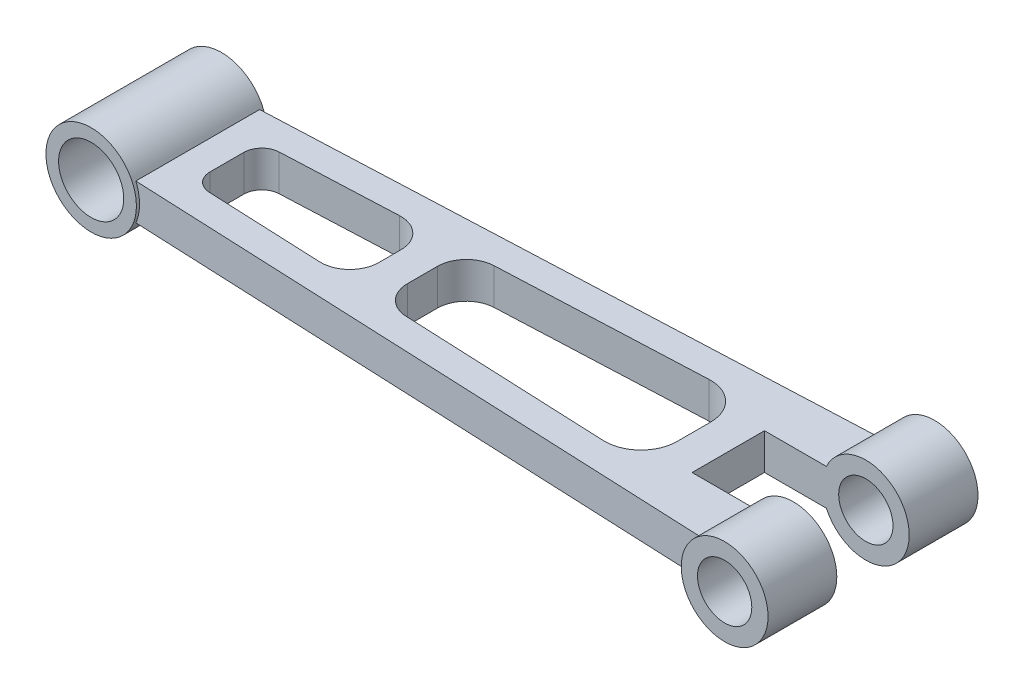
ISO-10303-21;
HEADER;
FILE_DESCRIPTION(('STEP AP214'),'2;1');
FILE_NAME('part.step','',(''),(''),'','','');
FILE_SCHEMA(('AUTOMOTIVE_DESIGN { 1 0 10303 214 1 1 1 1 }'));
ENDSEC;
DATA;
#1=APPLICATION_CONTEXT('core data for automotive mechanical design processes');
#2=APPLICATION_PROTOCOL_DEFINITION('international standard','automotive_design',2000,#1);
#3=PRODUCT_CONTEXT('',#1,'mechanical');
#4=PRODUCT('Part','Part','',(#3));
#5=PRODUCT_RELATED_PRODUCT_CATEGORY('part','',(#4));
#6=PRODUCT_DEFINITION_FORMATION('','',#4);
#7=PRODUCT_DEFINITION_CONTEXT('part definition',#1,'design');
#8=PRODUCT_DEFINITION('design','',#6,#7);
#9=PRODUCT_DEFINITION_SHAPE('','',#8);
#10=(LENGTH_UNIT() NAMED_UNIT(*) SI_UNIT(.MILLI.,.METRE.));
#11=(NAMED_UNIT(*) PLANE_ANGLE_UNIT() SI_UNIT($,.RADIAN.));
#12=(NAMED_UNIT(*) SI_UNIT($,.STERADIAN.) SOLID_ANGLE_UNIT());
#13=UNCERTAINTY_MEASURE_WITH_UNIT(LENGTH_MEASURE(1.E-05),#10,'distance_accuracy_value','');
#14=(GEOMETRIC_REPRESENTATION_CONTEXT(3) GLOBAL_UNCERTAINTY_ASSIGNED_CONTEXT((#13)) GLOBAL_UNIT_ASSIGNED_CONTEXT((#10,
#11,#12)) REPRESENTATION_CONTEXT('',''));
#15=CARTESIAN_POINT('',(0.,0.,0.));
#16=DIRECTION('',(0.,0.,1.));
#17=DIRECTION('',(1.,0.,0.));
#18=AXIS2_PLACEMENT_3D('',#15,#16,#17);
#19=CARTESIAN_POINT('',(-93.25,5.,-18.));
#20=DIRECTION('',(0.,0.,1.));
#21=DIRECTION('',(1.,0.,0.));
#22=AXIS2_PLACEMENT_3D('',#19,#20,#21);
#23=CYLINDRICAL_SURFACE('',#22,12.5);
#24=CARTESIAN_POINT('',(-93.25,5.,-18.));
#25=DIRECTION('',(0.,0.,1.));
#26=DIRECTION('',(1.,0.,0.));
#27=AXIS2_PLACEMENT_3D('',#24,#25,#26);
#28=CIRCLE('',#27,12.5);
#29=CARTESIAN_POINT('',(-80.75,5.,-18.));
#30=VERTEX_POINT('',#29);
#31=EDGE_CURVE('E11',#30,#30,#28,.T.);
#32=ORIENTED_EDGE('',*,*,#31,.T.);
#33=EDGE_LOOP('',(#32));
#34=FACE_BOUND('',#33,.T.);
#35=CARTESIAN_POINT('',(-93.25,5.,18.));
#36=DIRECTION('',(0.,0.,1.));
#37=DIRECTION('',(1.,0.,0.));
#38=AXIS2_PLACEMENT_3D('',#35,#36,#37);
#39=CIRCLE('',#38,12.5);
#40=CARTESIAN_POINT('',(-80.75,5.,18.));
#41=VERTEX_POINT('',#40);
#42=EDGE_CURVE('E57',#41,#41,#39,.T.);
#43=ORIENTED_EDGE('',*,*,#42,.F.);
#44=EDGE_LOOP('',(#43));
#45=FACE_BOUND('',#44,.T.);
#46=ADVANCED_FACE('F51',(#34,#45),#23,.T.);
#47=CARTESIAN_POINT('',(-93.25,5.,-18.));
#48=DIRECTION('',(0.,0.,1.));
#49=DIRECTION('',(1.,0.,0.));
#50=AXIS2_PLACEMENT_3D('',#47,#48,#49);
#51=PLANE('',#50);
#52=CARTESIAN_POINT('',(-93.25,5.,-18.));
#53=DIRECTION('',(0.,0.,1.));
#54=DIRECTION('',(1.,0.,0.));
#55=AXIS2_PLACEMENT_3D('',#52,#53,#54);
#56=CIRCLE('',#55,9.);
#57=CARTESIAN_POINT('',(-84.25,5.,-18.));
#58=VERTEX_POINT('',#57);
#59=EDGE_CURVE('E61',#58,#58,#56,.T.);
#60=ORIENTED_EDGE('',*,*,#59,.T.);
#61=EDGE_LOOP('',(#60));
#62=FACE_BOUND('',#61,.T.);
#63=ORIENTED_EDGE('',*,*,#31,.F.);
#64=EDGE_LOOP('',(#63));
#65=FACE_BOUND('',#64,.T.);
#66=ADVANCED_FACE('F76',(#62,#65),#51,.F.);
#67=CARTESIAN_POINT('',(-93.25,5.,18.));
#68=DIRECTION('',(0.,0.,1.));
#69=DIRECTION('',(1.,0.,0.));
#70=AXIS2_PLACEMENT_3D('',#67,#68,#69);
#71=PLANE('',#70);
#72=CARTESIAN_POINT('',(-93.25,5.,18.));
#73=DIRECTION('',(0.,0.,1.));
#74=DIRECTION('',(1.,0.,0.));
#75=AXIS2_PLACEMENT_3D('',#72,#73,#74);
#76=CIRCLE('',#75,9.);
#77=CARTESIAN_POINT('',(-84.25,5.,18.));
#78=VERTEX_POINT('',#77);
#79=EDGE_CURVE('E65',#78,#78,#76,.T.);
#80=ORIENTED_EDGE('',*,*,#79,.F.);
#81=EDGE_LOOP('',(#80));
#82=FACE_BOUND('',#81,.T.);
#83=ORIENTED_EDGE('',*,*,#42,.T.);
#84=EDGE_LOOP('',(#83));
#85=FACE_BOUND('',#84,.T.);
#86=ADVANCED_FACE('F74',(#82,#85),#71,.T.);
#87=CARTESIAN_POINT('',(-93.25,5.,-24.2802101213737));
#88=DIRECTION('',(0.,0.,1.));
#89=DIRECTION('',(1.,0.,0.));
#90=AXIS2_PLACEMENT_3D('',#87,#88,#89);
#91=CYLINDRICAL_SURFACE('',#90,9.);
#92=ORIENTED_EDGE('',*,*,#79,.T.);
#93=EDGE_LOOP('',(#92));
#94=FACE_BOUND('',#93,.T.);
#95=ORIENTED_EDGE('',*,*,#59,.F.);
#96=EDGE_LOOP('',(#95));
#97=FACE_BOUND('',#96,.T.);
#98=ADVANCED_FACE('F71',(#94,#97),#91,.F.);
#99=CLOSED_SHELL('',(#46,#66,#86,#98));
#100=MANIFOLD_SOLID_BREP('B2',#99);
#101=CARTESIAN_POINT('',(92.7404822158186,5.,-29.));
#102=DIRECTION('',(0.,0.,1.));
#103=DIRECTION('',(1.,0.,0.));
#104=AXIS2_PLACEMENT_3D('',#101,#102,#103);
#105=CYLINDRICAL_SURFACE('',#104,11.9885786589823);
#106=DIRECTION('',(0.,0.,1.));
#107=VECTOR('',#106,1.);
#108=CARTESIAN_POINT('',(81.8443352701039,10.,-29.));
#109=LINE('',#108,#107);
#110=CARTESIAN_POINT('',(81.8443352701039,10.,-10.));
#111=VERTEX_POINT('',#110);
#112=CARTESIAN_POINT('',(81.8443352701039,10.,-24.2406679453075));
#113=VERTEX_POINT('',#112);
#114=EDGE_CURVE('E308',#111,#113,#109,.F.);
#115=ORIENTED_EDGE('',*,*,#114,.F.);
#116=CARTESIAN_POINT('',(92.7404822158186,5.,-10.));
#117=DIRECTION('',(0.,0.,-1.));
#118=DIRECTION('',(-1.,0.,0.));
#119=AXIS2_PLACEMENT_3D('',#116,#117,#118);
#120=CIRCLE('',#119,11.9885786589823);
#121=CARTESIAN_POINT('',(81.8443352701039,0.,-10.));
#122=VERTEX_POINT('',#121);
#123=EDGE_CURVE('E295',#122,#111,#120,.F.);
#124=ORIENTED_EDGE('',*,*,#123,.F.);
#125=DIRECTION('',(0.,0.,1.));
#126=VECTOR('',#125,1.);
#127=CARTESIAN_POINT('',(81.8443352701039,0.,-29.));
#128=LINE('',#127,#126);
#129=CARTESIAN_POINT('',(81.8443352701039,0.,-24.2406679453075));
#130=VERTEX_POINT('',#129);
#131=EDGE_CURVE('E918',#122,#130,#128,.F.);
#132=ORIENTED_EDGE('',*,*,#131,.T.);
#133=CARTESIAN_POINT('',(92.7404822158186,5.,-24.716403995027));
#134=DIRECTION('',(0.0436193873653291,0.,0.999048221581858));
#135=DIRECTION('',(-0.999048221581858,0.,0.0436193873653291));
#136=AXIS2_PLACEMENT_3D('',#133,#134,#135);
#137=ELLIPSE('',#136,12.,11.9885786589823);
#138=EDGE_CURVE('E442',#113,#130,#137,.T.);
#139=ORIENTED_EDGE('',*,*,#138,.F.);
#140=EDGE_LOOP('',(#115,#124,#132,#139));
#141=FACE_BOUND('',#140,.T.);
#142=CARTESIAN_POINT('',(92.7404822158186,5.,-29.));
#143=DIRECTION('',(0.,0.,1.));
#144=DIRECTION('',(1.,0.,0.));
#145=AXIS2_PLACEMENT_3D('',#142,#143,#144);
#146=CIRCLE('',#145,11.9885786589823);
#147=CARTESIAN_POINT('',(104.729060874801,5.,-29.));
#148=VERTEX_POINT('',#147);
#149=EDGE_CURVE('E949',#148,#148,#146,.T.);
#150=ORIENTED_EDGE('',*,*,#149,.T.);
#151=EDGE_LOOP('',(#150));
#152=FACE_BOUND('',#151,.T.);
#153=ADVANCED_FACE('F121',(#141,#152),#105,.T.);
#154=CARTESIAN_POINT('',(92.7404822158186,5.,-29.));
#155=DIRECTION('',(0.,0.,1.));
#156=DIRECTION('',(1.,0.,0.));
#157=AXIS2_PLACEMENT_3D('',#154,#155,#156);
#158=CYLINDRICAL_SURFACE('',#157,7.50000000000001);
#159=CARTESIAN_POINT('',(92.7404822158186,5.,-29.));
#160=DIRECTION('',(0.,0.,1.));
#161=DIRECTION('',(1.,0.,0.));
#162=AXIS2_PLACEMENT_3D('',#159,#160,#161);
#163=CIRCLE('',#162,7.50000000000001);
#164=CARTESIAN_POINT('',(100.240482215819,5.,-29.));
#165=VERTEX_POINT('',#164);
#166=EDGE_CURVE('E941',#165,#165,#163,.T.);
#167=ORIENTED_EDGE('',*,*,#166,.F.);
#168=EDGE_LOOP('',(#167));
#169=FACE_BOUND('',#168,.T.);
#170=CARTESIAN_POINT('',(92.7404822158186,5.,-10.));
#171=DIRECTION('',(0.,0.,-1.));
#172=DIRECTION('',(-1.,0.,0.));
#173=AXIS2_PLACEMENT_3D('',#170,#171,#172);
#174=CIRCLE('',#173,7.50000000000001);
#175=CARTESIAN_POINT('',(85.2404822158186,5.,-10.));
#176=VERTEX_POINT('',#175);
#177=EDGE_CURVE('E49',#176,#176,#174,.F.);
#178=ORIENTED_EDGE('',*,*,#177,.T.);
#179=EDGE_LOOP('',(#178));
#180=FACE_BOUND('',#179,.T.);
#181=ADVANCED_FACE('F553',(#169,#180),#158,.F.);
#182=CARTESIAN_POINT('',(-82.75,10.,-17.0543240700161));
#183=DIRECTION('',(0.0436193873653291,0.,0.999048221581858));
#184=DIRECTION('',(0.999048221581858,0.,-0.0436193873653291));
#185=AXIS2_PLACEMENT_3D('',#182,#183,#184);
#186=PLANE('',#185);
#187=DIRECTION('',(-0.999048221581858,0.,0.0436193873653291));
#188=VECTOR('',#187,1.);
#189=CARTESIAN_POINT('',(-82.75,10.,-17.0543240700161));
#190=LINE('',#189,#188);
#191=CARTESIAN_POINT('',(-82.75,10.,-17.0543240700161));
#192=VERTEX_POINT('',#191);
#193=EDGE_CURVE('E513',#113,#192,#190,.T.);
#194=ORIENTED_EDGE('',*,*,#193,.F.);
#195=ORIENTED_EDGE('',*,*,#138,.T.);
#196=DIRECTION('',(-0.999048221581858,0.,0.0436193873653291));
#197=VECTOR('',#196,1.);
#198=CARTESIAN_POINT('',(-82.75,0.,-17.0543240700161));
#199=LINE('',#198,#197);
#200=CARTESIAN_POINT('',(-82.75,0.,-17.0543240700161));
#201=VERTEX_POINT('',#200);
#202=EDGE_CURVE('E512',#130,#201,#199,.T.);
#203=ORIENTED_EDGE('',*,*,#202,.T.);
#204=DIRECTION('',(0.,-1.,0.));
#205=VECTOR('',#204,1.);
#206=CARTESIAN_POINT('',(-82.75,10.,-17.0543240700161));
#207=LINE('',#206,#205);
#208=EDGE_CURVE('E520',#192,#201,#207,.T.);
#209=ORIENTED_EDGE('',*,*,#208,.F.);
#210=EDGE_LOOP('',(#194,#195,#203,#209));
#211=FACE_BOUND('',#210,.T.);
#212=ADVANCED_FACE('F123',(#211),#186,.F.);
#213=CARTESIAN_POINT('',(-82.75,10.,0.));
#214=DIRECTION('',(1.,0.,0.));
#215=DIRECTION('',(0.,0.,-1.));
#216=AXIS2_PLACEMENT_3D('',#213,#214,#215);
#217=PLANE('',#216);
#218=DIRECTION('',(0.,0.,1.));
#219=VECTOR('',#218,1.);
#220=CARTESIAN_POINT('',(-82.75,0.,0.));
#221=LINE('',#220,#219);
#222=CARTESIAN_POINT('',(-82.75,0.,17.0543240700161));
#223=VERTEX_POINT('',#222);
#224=EDGE_CURVE('E517',#201,#223,#221,.T.);
#225=ORIENTED_EDGE('',*,*,#224,.T.);
#226=DIRECTION('',(0.,-1.,0.));
#227=VECTOR('',#226,1.);
#228=CARTESIAN_POINT('',(-82.75,10.,17.0543240700161));
#229=LINE('',#228,#227);
#230=CARTESIAN_POINT('',(-82.75,10.,17.0543240700161));
#231=VERTEX_POINT('',#230);
#232=EDGE_CURVE('E506',#231,#223,#229,.T.);
#233=ORIENTED_EDGE('',*,*,#232,.F.);
#234=DIRECTION('',(0.,0.,1.));
#235=VECTOR('',#234,1.);
#236=CARTESIAN_POINT('',(-82.75,10.,0.));
#237=LINE('',#236,#235);
#238=EDGE_CURVE('E516',#192,#231,#237,.T.);
#239=ORIENTED_EDGE('',*,*,#238,.F.);
#240=ORIENTED_EDGE('',*,*,#208,.T.);
#241=EDGE_LOOP('',(#225,#233,#239,#240));
#242=FACE_BOUND('',#241,.T.);
#243=ADVANCED_FACE('F624',(#242),#217,.F.);
#244=CARTESIAN_POINT('',(0.,10.,0.));
#245=DIRECTION('',(0.,-1.,0.));
#246=DIRECTION('',(0.,0.,-1.));
#247=AXIS2_PLACEMENT_3D('',#244,#245,#246);
#248=PLANE('',#247);
#249=DIRECTION('',(0.,0.,1.));
#250=VECTOR('',#249,1.);
#251=CARTESIAN_POINT('',(-73.75,10.,4.653192363612));
#252=LINE('',#251,#250);
#253=CARTESIAN_POINT('',(-73.75,10.,-4.653192363612));
#254=VERTEX_POINT('',#253);
#255=CARTESIAN_POINT('',(-73.75,10.,4.653192363612));
#256=VERTEX_POINT('',#255);
#257=EDGE_CURVE('E381',#254,#256,#252,.T.);
#258=ORIENTED_EDGE('',*,*,#257,.F.);
#259=CARTESIAN_POINT('',(-68.75,10.,-4.65319236361204));
#260=DIRECTION('',(0.,1.,0.));
#261=DIRECTION('',(0.,0.,1.));
#262=AXIS2_PLACEMENT_3D('',#259,#260,#261);
#263=CIRCLE('',#262,5.);
#264=CARTESIAN_POINT('',(-68.9680969368266,10.,-9.64843347152133));
#265=VERTEX_POINT('',#264);
#266=EDGE_CURVE('E137',#265,#254,#263,.T.);
#267=ORIENTED_EDGE('',*,*,#266,.F.);
#268=DIRECTION('',(-0.999048221581858,0.,0.0436193873653292));
#269=VECTOR('',#268,1.);
#270=CARTESIAN_POINT('',(-68.9680969368266,10.,-9.64843347152133));
#271=LINE('',#270,#269);
#272=CARTESIAN_POINT('',(-37.0989550989227,10.,-11.0398702538491));
#273=VERTEX_POINT('',#272);
#274=EDGE_CURVE('E356',#273,#265,#271,.T.);
#275=ORIENTED_EDGE('',*,*,#274,.F.);
#276=CARTESIAN_POINT('',(-36.75,10.,-3.04748448119425));
#277=DIRECTION('',(0.,1.,0.));
#278=DIRECTION('',(0.,0.,-1.));
#279=AXIS2_PLACEMENT_3D('',#276,#277,#278);
#280=CIRCLE('',#279,8.);
#281=CARTESIAN_POINT('',(-28.75,10.,-3.04748448119419));
#282=VERTEX_POINT('',#281);
#283=EDGE_CURVE('E360',#282,#273,#280,.T.);
#284=ORIENTED_EDGE('',*,*,#283,.F.);
#285=DIRECTION('',(0.,0.,-1.));
#286=VECTOR('',#285,1.);
#287=CARTESIAN_POINT('',(-28.75,10.,-3.04748448119419));
#288=LINE('',#287,#286);
#289=CARTESIAN_POINT('',(-28.75,10.,3.04748448119418));
#290=VERTEX_POINT('',#289);
#291=EDGE_CURVE('E365',#290,#282,#288,.T.);
#292=ORIENTED_EDGE('',*,*,#291,.F.);
#293=CARTESIAN_POINT('',(-36.75,10.,3.04748448119424));
#294=DIRECTION('',(0.,1.,0.));
#295=DIRECTION('',(0.,0.,-1.));
#296=AXIS2_PLACEMENT_3D('',#293,#294,#295);
#297=CIRCLE('',#296,8.);
#298=CARTESIAN_POINT('',(-37.0989550989227,10.,11.0398702538491));
#299=VERTEX_POINT('',#298);
#300=EDGE_CURVE('E369',#299,#290,#297,.T.);
#301=ORIENTED_EDGE('',*,*,#300,.F.);
#302=DIRECTION('',(0.999048221581858,0.,0.0436193873653291));
#303=VECTOR('',#302,1.);
#304=CARTESIAN_POINT('',(-37.0989550989227,10.,11.0398702538491));
#305=LINE('',#304,#303);
#306=CARTESIAN_POINT('',(-68.9680969368266,10.,9.64843347152132));
#307=VERTEX_POINT('',#306);
#308=EDGE_CURVE('E373',#307,#299,#305,.T.);
#309=ORIENTED_EDGE('',*,*,#308,.F.);
#310=CARTESIAN_POINT('',(-68.75,10.,4.65319236361203));
#311=DIRECTION('',(0.,1.,0.));
#312=DIRECTION('',(0.,0.,-1.));
#313=AXIS2_PLACEMENT_3D('',#310,#311,#312);
#314=CIRCLE('',#313,5.);
#315=EDGE_CURVE('E377',#256,#307,#314,.T.);
#316=ORIENTED_EDGE('',*,*,#315,.F.);
#317=EDGE_LOOP('',(#258,#267,#275,#284,#292,#301,#309,#316));
#318=FACE_BOUND('',#317,.T.);
#319=DIRECTION('',(0.999048221581858,0.,0.043619387365329));
#320=VECTOR('',#319,1.);
#321=CARTESIAN_POINT('',(-12.0989550989226,10.,12.1313938265617));
#322=LINE('',#321,#320);
#323=CARTESIAN_POINT('',(-12.0989550989226,10.,12.1313938265617));
#324=VERTEX_POINT('',#323);
#325=CARTESIAN_POINT('',(44.8138061263466,10.,14.6162586451836));
#326=VERTEX_POINT('',#325);
#327=EDGE_CURVE('E468',#324,#326,#322,.T.);
#328=ORIENTED_EDGE('',*,*,#327,.F.);
#329=CARTESIAN_POINT('',(-11.75,10.,4.13900805390687));
#330=DIRECTION('',(0.,1.,0.));
#331=DIRECTION('',(0.,0.,1.));
#332=AXIS2_PLACEMENT_3D('',#329,#330,#331);
#333=CIRCLE('',#332,8.);
#334=CARTESIAN_POINT('',(-19.75,10.,4.13900805390682));
#335=VERTEX_POINT('',#334);
#336=EDGE_CURVE('E145',#335,#324,#333,.T.);
#337=ORIENTED_EDGE('',*,*,#336,.F.);
#338=DIRECTION('',(0.,0.,1.));
#339=VECTOR('',#338,1.);
#340=CARTESIAN_POINT('',(-19.75,10.,-4.13900805390681));
#341=LINE('',#340,#339);
#342=CARTESIAN_POINT('',(-19.75,10.,-4.13900805390681));
#343=VERTEX_POINT('',#342);
#344=EDGE_CURVE('E443',#343,#335,#341,.T.);
#345=ORIENTED_EDGE('',*,*,#344,.F.);
#346=CARTESIAN_POINT('',(-11.75,10.,-4.13900805390687));
#347=DIRECTION('',(0.,1.,0.));
#348=DIRECTION('',(0.,0.,-1.));
#349=AXIS2_PLACEMENT_3D('',#346,#347,#348);
#350=CIRCLE('',#349,8.);
#351=CARTESIAN_POINT('',(-12.0989550989226,10.,-12.1313938265617));
#352=VERTEX_POINT('',#351);
#353=EDGE_CURVE('E447',#352,#343,#350,.T.);
#354=ORIENTED_EDGE('',*,*,#353,.F.);
#355=DIRECTION('',(-0.999048221581858,0.,0.0436193873653291));
#356=VECTOR('',#355,1.);
#357=CARTESIAN_POINT('',(44.8138061263466,10.,-14.6162586451836));
#358=LINE('',#357,#356);
#359=CARTESIAN_POINT('',(44.8138061263466,10.,-14.6162586451836));
#360=VERTEX_POINT('',#359);
#361=EDGE_CURVE('E452',#360,#352,#358,.T.);
#362=ORIENTED_EDGE('',*,*,#361,.F.);
#363=CARTESIAN_POINT('',(45.25,10.,-4.62577642936502));
#364=DIRECTION('',(0.,1.,0.));
#365=DIRECTION('',(0.,0.,1.));
#366=AXIS2_PLACEMENT_3D('',#363,#364,#365);
#367=CIRCLE('',#366,10.);
#368=CARTESIAN_POINT('',(55.25,10.,-4.62577642936495));
#369=VERTEX_POINT('',#368);
#370=EDGE_CURVE('E456',#369,#360,#367,.T.);
#371=ORIENTED_EDGE('',*,*,#370,.F.);
#372=DIRECTION('',(0.,0.,-1.));
#373=VECTOR('',#372,1.);
#374=CARTESIAN_POINT('',(55.25,10.,4.62577642936494));
#375=LINE('',#374,#373);
#376=CARTESIAN_POINT('',(55.25,10.,4.62577642936494));
#377=VERTEX_POINT('',#376);
#378=EDGE_CURVE('E460',#377,#369,#375,.T.);
#379=ORIENTED_EDGE('',*,*,#378,.F.);
#380=CARTESIAN_POINT('',(45.25,10.,4.62577642936501));
#381=DIRECTION('',(0.,1.,0.));
#382=DIRECTION('',(0.,0.,1.));
#383=AXIS2_PLACEMENT_3D('',#380,#381,#382);
#384=CIRCLE('',#383,10.);
#385=EDGE_CURVE('E464',#326,#377,#384,.T.);
#386=ORIENTED_EDGE('',*,*,#385,.F.);
#387=EDGE_LOOP('',(#328,#337,#345,#354,#362,#371,#379,#386));
#388=FACE_BOUND('',#387,.T.);
#389=DIRECTION('',(-0.999048221581858,0.,-0.0436193873653291));
#390=VECTOR('',#389,1.);
#391=CARTESIAN_POINT('',(-82.75,10.,17.0543240700161));
#392=LINE('',#391,#390);
#393=CARTESIAN_POINT('',(81.8443352701039,10.,24.2406679453075));
#394=VERTEX_POINT('',#393);
#395=EDGE_CURVE('E304',#394,#231,#392,.T.);
#396=ORIENTED_EDGE('',*,*,#395,.F.);
#397=CARTESIAN_POINT('',(81.8443352701039,10.,10.));
#398=VERTEX_POINT('',#397);
#399=EDGE_CURVE('E286',#394,#398,#109,.F.);
#400=ORIENTED_EDGE('',*,*,#399,.T.);
#401=DIRECTION('',(1.,0.,0.));
#402=VECTOR('',#401,1.);
#403=CARTESIAN_POINT('',(64.75,10.,10.));
#404=LINE('',#403,#402);
#405=CARTESIAN_POINT('',(64.75,10.,10.));
#406=VERTEX_POINT('',#405);
#407=EDGE_CURVE('E302',#406,#398,#404,.T.);
#408=ORIENTED_EDGE('',*,*,#407,.F.);
#409=DIRECTION('',(0.,0.,1.));
#410=VECTOR('',#409,1.);
#411=CARTESIAN_POINT('',(64.75,10.,-10.));
#412=LINE('',#411,#410);
#413=CARTESIAN_POINT('',(64.75,10.,-10.));
#414=VERTEX_POINT('',#413);
#415=EDGE_CURVE('E314',#414,#406,#412,.T.);
#416=ORIENTED_EDGE('',*,*,#415,.F.);
#417=DIRECTION('',(-1.,0.,0.));
#418=VECTOR('',#417,1.);
#419=CARTESIAN_POINT('',(64.75,10.,-10.));
#420=LINE('',#419,#418);
#421=EDGE_CURVE('E313',#111,#414,#420,.T.);
#422=ORIENTED_EDGE('',*,*,#421,.F.);
#423=ORIENTED_EDGE('',*,*,#114,.T.);
#424=ORIENTED_EDGE('',*,*,#193,.T.);
#425=ORIENTED_EDGE('',*,*,#238,.T.);
#426=EDGE_LOOP('',(#396,#400,#408,#416,#422,#423,#424,#425));
#427=FACE_BOUND('',#426,.T.);
#428=ADVANCED_FACE('F300',(#318,#388,#427),#248,.F.);
#429=CARTESIAN_POINT('',(0.,0.,0.));
#430=DIRECTION('',(0.,-1.,0.));
#431=DIRECTION('',(0.,0.,-1.));
#432=AXIS2_PLACEMENT_3D('',#429,#430,#431);
#433=PLANE('',#432);
#434=CARTESIAN_POINT('',(81.8443352701039,0.,24.2406679453075));
#435=VERTEX_POINT('',#434);
#436=CARTESIAN_POINT('',(81.8443352701039,0.,10.));
#437=VERTEX_POINT('',#436);
#438=EDGE_CURVE('E289',#435,#437,#128,.F.);
#439=ORIENTED_EDGE('',*,*,#438,.F.);
#440=DIRECTION('',(-0.999048221581858,0.,-0.0436193873653291));
#441=VECTOR('',#440,1.);
#442=CARTESIAN_POINT('',(-82.75,0.,17.0543240700161));
#443=LINE('',#442,#441);
#444=EDGE_CURVE('E327',#435,#223,#443,.T.);
#445=ORIENTED_EDGE('',*,*,#444,.T.);
#446=ORIENTED_EDGE('',*,*,#224,.F.);
#447=ORIENTED_EDGE('',*,*,#202,.F.);
#448=ORIENTED_EDGE('',*,*,#131,.F.);
#449=DIRECTION('',(1.,0.,0.));
#450=VECTOR('',#449,1.);
#451=CARTESIAN_POINT('',(0.,0.,-10.));
#452=LINE('',#451,#450);
#453=CARTESIAN_POINT('',(64.75,0.,-10.));
#454=VERTEX_POINT('',#453);
#455=EDGE_CURVE('E529',#454,#122,#452,.T.);
#456=ORIENTED_EDGE('',*,*,#455,.F.);
#457=DIRECTION('',(0.,0.,1.));
#458=VECTOR('',#457,1.);
#459=CARTESIAN_POINT('',(64.75,0.,-10.));
#460=LINE('',#459,#458);
#461=CARTESIAN_POINT('',(64.75,0.,10.));
#462=VERTEX_POINT('',#461);
#463=EDGE_CURVE('E318',#454,#462,#460,.T.);
#464=ORIENTED_EDGE('',*,*,#463,.T.);
#465=DIRECTION('',(1.,0.,0.));
#466=VECTOR('',#465,1.);
#467=CARTESIAN_POINT('',(64.75,0.,10.));
#468=LINE('',#467,#466);
#469=EDGE_CURVE('E330',#462,#437,#468,.T.);
#470=ORIENTED_EDGE('',*,*,#469,.T.);
#471=EDGE_LOOP('',(#439,#445,#446,#447,#448,#456,#464,#470));
#472=FACE_BOUND('',#471,.T.);
#473=CARTESIAN_POINT('',(-68.75,0.,-4.65319236361204));
#474=DIRECTION('',(0.,1.,0.));
#475=DIRECTION('',(0.,0.,1.));
#476=AXIS2_PLACEMENT_3D('',#473,#474,#475);
#477=CIRCLE('',#476,5.);
#478=CARTESIAN_POINT('',(-68.9680969368266,0.,-9.64843347152133));
#479=VERTEX_POINT('',#478);
#480=CARTESIAN_POINT('',(-73.75,0.,-4.653192363612));
#481=VERTEX_POINT('',#480);
#482=EDGE_CURVE('E361',#479,#481,#477,.T.);
#483=ORIENTED_EDGE('',*,*,#482,.T.);
#484=DIRECTION('',(0.,0.,1.));
#485=VECTOR('',#484,1.);
#486=CARTESIAN_POINT('',(-73.75,0.,4.653192363612));
#487=LINE('',#486,#485);
#488=CARTESIAN_POINT('',(-73.75,0.,4.653192363612));
#489=VERTEX_POINT('',#488);
#490=EDGE_CURVE('E410',#481,#489,#487,.T.);
#491=ORIENTED_EDGE('',*,*,#490,.T.);
#492=CARTESIAN_POINT('',(-68.75,0.,4.65319236361203));
#493=DIRECTION('',(0.,1.,0.));
#494=DIRECTION('',(0.,0.,-1.));
#495=AXIS2_PLACEMENT_3D('',#492,#493,#494);
#496=CIRCLE('',#495,5.);
#497=CARTESIAN_POINT('',(-68.9680969368266,0.,9.64843347152132));
#498=VERTEX_POINT('',#497);
#499=EDGE_CURVE('E406',#489,#498,#496,.T.);
#500=ORIENTED_EDGE('',*,*,#499,.T.);
#501=DIRECTION('',(0.999048221581858,0.,0.0436193873653291));
#502=VECTOR('',#501,1.);
#503=CARTESIAN_POINT('',(-37.0989550989227,0.,11.0398702538491));
#504=LINE('',#503,#502);
#505=CARTESIAN_POINT('',(-37.0989550989227,0.,11.0398702538491));
#506=VERTEX_POINT('',#505);
#507=EDGE_CURVE('E402',#498,#506,#504,.T.);
#508=ORIENTED_EDGE('',*,*,#507,.T.);
#509=CARTESIAN_POINT('',(-36.75,0.,3.04748448119424));
#510=DIRECTION('',(0.,1.,0.));
#511=DIRECTION('',(0.,0.,-1.));
#512=AXIS2_PLACEMENT_3D('',#509,#510,#511);
#513=CIRCLE('',#512,8.);
#514=CARTESIAN_POINT('',(-28.75,0.,3.04748448119418));
#515=VERTEX_POINT('',#514);
#516=EDGE_CURVE('E398',#506,#515,#513,.T.);
#517=ORIENTED_EDGE('',*,*,#516,.T.);
#518=DIRECTION('',(0.,0.,-1.));
#519=VECTOR('',#518,1.);
#520=CARTESIAN_POINT('',(-28.75,0.,-3.04748448119419));
#521=LINE('',#520,#519);
#522=CARTESIAN_POINT('',(-28.75,0.,-3.04748448119419));
#523=VERTEX_POINT('',#522);
#524=EDGE_CURVE('E394',#515,#523,#521,.T.);
#525=ORIENTED_EDGE('',*,*,#524,.T.);
#526=CARTESIAN_POINT('',(-36.75,0.,-3.04748448119425));
#527=DIRECTION('',(0.,1.,0.));
#528=DIRECTION('',(0.,0.,-1.));
#529=AXIS2_PLACEMENT_3D('',#526,#527,#528);
#530=CIRCLE('',#529,8.);
#531=CARTESIAN_POINT('',(-37.0989550989227,0.,-11.0398702538491));
#532=VERTEX_POINT('',#531);
#533=EDGE_CURVE('E390',#523,#532,#530,.T.);
#534=ORIENTED_EDGE('',*,*,#533,.T.);
#535=DIRECTION('',(-0.999048221581858,0.,0.0436193873653292));
#536=VECTOR('',#535,1.);
#537=CARTESIAN_POINT('',(-68.9680969368266,0.,-9.64843347152133));
#538=LINE('',#537,#536);
#539=EDGE_CURVE('E334',#532,#479,#538,.T.);
#540=ORIENTED_EDGE('',*,*,#539,.T.);
#541=EDGE_LOOP('',(#483,#491,#500,#508,#517,#525,#534,#540));
#542=FACE_BOUND('',#541,.T.);
#543=CARTESIAN_POINT('',(-11.75,0.,4.13900805390687));
#544=DIRECTION('',(0.,1.,0.));
#545=DIRECTION('',(0.,0.,1.));
#546=AXIS2_PLACEMENT_3D('',#543,#544,#545);
#547=CIRCLE('',#546,8.);
#548=CARTESIAN_POINT('',(-19.75,0.,4.13900805390682));
#549=VERTEX_POINT('',#548);
#550=CARTESIAN_POINT('',(-12.0989550989226,0.,12.1313938265617));
#551=VERTEX_POINT('',#550);
#552=EDGE_CURVE('E448',#549,#551,#547,.T.);
#553=ORIENTED_EDGE('',*,*,#552,.T.);
#554=DIRECTION('',(0.999048221581858,0.,0.043619387365329));
#555=VECTOR('',#554,1.);
#556=CARTESIAN_POINT('',(-12.0989550989226,0.,12.1313938265617));
#557=LINE('',#556,#555);
#558=CARTESIAN_POINT('',(44.8138061263466,0.,14.6162586451836));
#559=VERTEX_POINT('',#558);
#560=EDGE_CURVE('E497',#551,#559,#557,.T.);
#561=ORIENTED_EDGE('',*,*,#560,.T.);
#562=CARTESIAN_POINT('',(45.25,0.,4.62577642936501));
#563=DIRECTION('',(0.,1.,0.));
#564=DIRECTION('',(0.,0.,1.));
#565=AXIS2_PLACEMENT_3D('',#562,#563,#564);
#566=CIRCLE('',#565,10.);
#567=CARTESIAN_POINT('',(55.25,0.,4.62577642936494));
#568=VERTEX_POINT('',#567);
#569=EDGE_CURVE('E493',#559,#568,#566,.T.);
#570=ORIENTED_EDGE('',*,*,#569,.T.);
#571=DIRECTION('',(0.,0.,-1.));
#572=VECTOR('',#571,1.);
#573=CARTESIAN_POINT('',(55.25,0.,4.62577642936494));
#574=LINE('',#573,#572);
#575=CARTESIAN_POINT('',(55.25,0.,-4.62577642936495));
#576=VERTEX_POINT('',#575);
#577=EDGE_CURVE('E489',#568,#576,#574,.T.);
#578=ORIENTED_EDGE('',*,*,#577,.T.);
#579=CARTESIAN_POINT('',(45.25,0.,-4.62577642936502));
#580=DIRECTION('',(0.,1.,0.));
#581=DIRECTION('',(0.,0.,1.));
#582=AXIS2_PLACEMENT_3D('',#579,#580,#581);
#583=CIRCLE('',#582,10.);
#584=CARTESIAN_POINT('',(44.8138061263466,0.,-14.6162586451836));
#585=VERTEX_POINT('',#584);
#586=EDGE_CURVE('E485',#576,#585,#583,.T.);
#587=ORIENTED_EDGE('',*,*,#586,.T.);
#588=DIRECTION('',(-0.999048221581858,0.,0.0436193873653291));
#589=VECTOR('',#588,1.);
#590=CARTESIAN_POINT('',(44.8138061263466,0.,-14.6162586451836));
#591=LINE('',#590,#589);
#592=CARTESIAN_POINT('',(-12.0989550989226,0.,-12.1313938265617));
#593=VERTEX_POINT('',#592);
#594=EDGE_CURVE('E481',#585,#593,#591,.T.);
#595=ORIENTED_EDGE('',*,*,#594,.T.);
#596=CARTESIAN_POINT('',(-11.75,0.,-4.13900805390687));
#597=DIRECTION('',(0.,1.,0.));
#598=DIRECTION('',(0.,0.,-1.));
#599=AXIS2_PLACEMENT_3D('',#596,#597,#598);
#600=CIRCLE('',#599,8.);
#601=CARTESIAN_POINT('',(-19.75,0.,-4.13900805390681));
#602=VERTEX_POINT('',#601);
#603=EDGE_CURVE('E477',#593,#602,#600,.T.);
#604=ORIENTED_EDGE('',*,*,#603,.T.);
#605=DIRECTION('',(0.,0.,1.));
#606=VECTOR('',#605,1.);
#607=CARTESIAN_POINT('',(-19.75,0.,-4.13900805390681));
#608=LINE('',#607,#606);
#609=EDGE_CURVE('E420',#602,#549,#608,.T.);
#610=ORIENTED_EDGE('',*,*,#609,.T.);
#611=EDGE_LOOP('',(#553,#561,#570,#578,#587,#595,#604,#610));
#612=FACE_BOUND('',#611,.T.);
#613=ADVANCED_FACE('F594',(#472,#542,#612),#433,.T.);
#614=CARTESIAN_POINT('',(-82.75,10.,17.0543240700161));
#615=DIRECTION('',(-0.0436193873653291,0.,0.999048221581858));
#616=DIRECTION('',(0.999048221581858,0.,0.0436193873653291));
#617=AXIS2_PLACEMENT_3D('',#614,#615,#616);
#618=PLANE('',#617);
#619=CARTESIAN_POINT('',(92.7404822158186,5.,24.716403995027));
#620=DIRECTION('',(-0.0436193873653291,0.,0.999048221581858));
#621=DIRECTION('',(0.999048221581858,0.,0.0436193873653291));
#622=AXIS2_PLACEMENT_3D('',#619,#620,#621);
#623=ELLIPSE('',#622,12.,11.9885786589823);
#624=EDGE_CURVE('E306',#394,#435,#623,.T.);
#625=ORIENTED_EDGE('',*,*,#624,.F.);
#626=ORIENTED_EDGE('',*,*,#395,.T.);
#627=ORIENTED_EDGE('',*,*,#232,.T.);
#628=ORIENTED_EDGE('',*,*,#444,.F.);
#629=EDGE_LOOP('',(#625,#626,#627,#628));
#630=FACE_BOUND('',#629,.T.);
#631=ADVANCED_FACE('F598',(#630),#618,.T.);
#632=CARTESIAN_POINT('',(-11.75,0.,4.13900805390687));
#633=DIRECTION('',(0.,1.,0.));
#634=DIRECTION('',(0.,0.,1.));
#635=AXIS2_PLACEMENT_3D('',#632,#633,#634);
#636=CYLINDRICAL_SURFACE('',#635,8.);
#637=ORIENTED_EDGE('',*,*,#336,.T.);
#638=DIRECTION('',(0.,1.,0.));
#639=VECTOR('',#638,1.);
#640=CARTESIAN_POINT('',(-12.0989550989226,0.,12.1313938265617));
#641=LINE('',#640,#639);
#642=EDGE_CURVE('E417',#551,#324,#641,.T.);
#643=ORIENTED_EDGE('',*,*,#642,.F.);
#644=ORIENTED_EDGE('',*,*,#552,.F.);
#645=DIRECTION('',(0.,1.,0.));
#646=VECTOR('',#645,1.);
#647=CARTESIAN_POINT('',(-19.75,0.,4.13900805390682));
#648=LINE('',#647,#646);
#649=EDGE_CURVE('E439',#549,#335,#648,.T.);
#650=ORIENTED_EDGE('',*,*,#649,.T.);
#651=EDGE_LOOP('',(#637,#643,#644,#650));
#652=FACE_BOUND('',#651,.T.);
#653=ADVANCED_FACE('F826',(#652),#636,.F.);
#654=CARTESIAN_POINT('',(-19.75,0.,-4.13900805390681));
#655=DIRECTION('',(-1.,0.,0.));
#656=DIRECTION('',(0.,0.,1.));
#657=AXIS2_PLACEMENT_3D('',#654,#655,#656);
#658=PLANE('',#657);
#659=ORIENTED_EDGE('',*,*,#344,.T.);
#660=ORIENTED_EDGE('',*,*,#649,.F.);
#661=ORIENTED_EDGE('',*,*,#609,.F.);
#662=DIRECTION('',(0.,1.,0.));
#663=VECTOR('',#662,1.);
#664=CARTESIAN_POINT('',(-19.75,0.,-4.13900805390681));
#665=LINE('',#664,#663);
#666=EDGE_CURVE('E436',#602,#343,#665,.T.);
#667=ORIENTED_EDGE('',*,*,#666,.T.);
#668=EDGE_LOOP('',(#659,#660,#661,#667));
#669=FACE_BOUND('',#668,.T.);
#670=ADVANCED_FACE('F816',(#669),#658,.F.);
#671=CARTESIAN_POINT('',(-11.75,0.,-4.13900805390687));
#672=DIRECTION('',(0.,1.,0.));
#673=DIRECTION('',(0.,0.,1.));
#674=AXIS2_PLACEMENT_3D('',#671,#672,#673);
#675=CYLINDRICAL_SURFACE('',#674,8.);
#676=ORIENTED_EDGE('',*,*,#353,.T.);
#677=ORIENTED_EDGE('',*,*,#666,.F.);
#678=ORIENTED_EDGE('',*,*,#603,.F.);
#679=DIRECTION('',(0.,1.,0.));
#680=VECTOR('',#679,1.);
#681=CARTESIAN_POINT('',(-12.0989550989226,0.,-12.1313938265617));
#682=LINE('',#681,#680);
#683=EDGE_CURVE('E433',#593,#352,#682,.T.);
#684=ORIENTED_EDGE('',*,*,#683,.T.);
#685=EDGE_LOOP('',(#676,#677,#678,#684));
#686=FACE_BOUND('',#685,.T.);
#687=ADVANCED_FACE('F806',(#686),#675,.F.);
#688=CARTESIAN_POINT('',(44.8138061263466,0.,-14.6162586451836));
#689=DIRECTION('',(-0.0436193873653291,0.,-0.999048221581858));
#690=DIRECTION('',(-0.999048221581858,0.,0.0436193873653291));
#691=AXIS2_PLACEMENT_3D('',#688,#689,#690);
#692=PLANE('',#691);
#693=ORIENTED_EDGE('',*,*,#361,.T.);
#694=ORIENTED_EDGE('',*,*,#683,.F.);
#695=ORIENTED_EDGE('',*,*,#594,.F.);
#696=DIRECTION('',(0.,1.,0.));
#697=VECTOR('',#696,1.);
#698=CARTESIAN_POINT('',(44.8138061263466,0.,-14.6162586451836));
#699=LINE('',#698,#697);
#700=EDGE_CURVE('E430',#585,#360,#699,.T.);
#701=ORIENTED_EDGE('',*,*,#700,.T.);
#702=EDGE_LOOP('',(#693,#694,#695,#701));
#703=FACE_BOUND('',#702,.T.);
#704=ADVANCED_FACE('F796',(#703),#692,.F.);
#705=CARTESIAN_POINT('',(45.25,0.,-4.62577642936502));
#706=DIRECTION('',(0.,1.,0.));
#707=DIRECTION('',(0.,0.,1.));
#708=AXIS2_PLACEMENT_3D('',#705,#706,#707);
#709=CYLINDRICAL_SURFACE('',#708,10.);
#710=ORIENTED_EDGE('',*,*,#370,.T.);
#711=ORIENTED_EDGE('',*,*,#700,.F.);
#712=ORIENTED_EDGE('',*,*,#586,.F.);
#713=DIRECTION('',(0.,1.,0.));
#714=VECTOR('',#713,1.);
#715=CARTESIAN_POINT('',(55.25,0.,-4.62577642936495));
#716=LINE('',#715,#714);
#717=EDGE_CURVE('E427',#576,#369,#716,.T.);
#718=ORIENTED_EDGE('',*,*,#717,.T.);
#719=EDGE_LOOP('',(#710,#711,#712,#718));
#720=FACE_BOUND('',#719,.T.);
#721=ADVANCED_FACE('F786',(#720),#709,.F.);
#722=CARTESIAN_POINT('',(55.25,0.,4.62577642936494));
#723=DIRECTION('',(1.,0.,0.));
#724=DIRECTION('',(0.,0.,-1.));
#725=AXIS2_PLACEMENT_3D('',#722,#723,#724);
#726=PLANE('',#725);
#727=ORIENTED_EDGE('',*,*,#378,.T.);
#728=ORIENTED_EDGE('',*,*,#717,.F.);
#729=ORIENTED_EDGE('',*,*,#577,.F.);
#730=DIRECTION('',(0.,1.,0.));
#731=VECTOR('',#730,1.);
#732=CARTESIAN_POINT('',(55.25,0.,4.62577642936494));
#733=LINE('',#732,#731);
#734=EDGE_CURVE('E424',#568,#377,#733,.T.);
#735=ORIENTED_EDGE('',*,*,#734,.T.);
#736=EDGE_LOOP('',(#727,#728,#729,#735));
#737=FACE_BOUND('',#736,.T.);
#738=ADVANCED_FACE('F776',(#737),#726,.F.);
#739=CARTESIAN_POINT('',(45.25,0.,4.62577642936501));
#740=DIRECTION('',(0.,1.,0.));
#741=DIRECTION('',(0.,0.,1.));
#742=AXIS2_PLACEMENT_3D('',#739,#740,#741);
#743=CYLINDRICAL_SURFACE('',#742,10.);
#744=ORIENTED_EDGE('',*,*,#385,.T.);
#745=ORIENTED_EDGE('',*,*,#734,.F.);
#746=ORIENTED_EDGE('',*,*,#569,.F.);
#747=DIRECTION('',(0.,1.,0.));
#748=VECTOR('',#747,1.);
#749=CARTESIAN_POINT('',(44.8138061263466,0.,14.6162586451836));
#750=LINE('',#749,#748);
#751=EDGE_CURVE('E421',#559,#326,#750,.T.);
#752=ORIENTED_EDGE('',*,*,#751,.T.);
#753=EDGE_LOOP('',(#744,#745,#746,#752));
#754=FACE_BOUND('',#753,.T.);
#755=ADVANCED_FACE('F766',(#754),#743,.F.);
#756=CARTESIAN_POINT('',(-12.0989550989226,0.,12.1313938265617));
#757=DIRECTION('',(-0.043619387365329,0.,0.999048221581858));
#758=DIRECTION('',(0.999048221581858,0.,0.043619387365329));
#759=AXIS2_PLACEMENT_3D('',#756,#757,#758);
#760=PLANE('',#759);
#761=ORIENTED_EDGE('',*,*,#327,.T.);
#762=ORIENTED_EDGE('',*,*,#751,.F.);
#763=ORIENTED_EDGE('',*,*,#560,.F.);
#764=ORIENTED_EDGE('',*,*,#642,.T.);
#765=EDGE_LOOP('',(#761,#762,#763,#764));
#766=FACE_BOUND('',#765,.T.);
#767=ADVANCED_FACE('F757',(#766),#760,.F.);
#768=CARTESIAN_POINT('',(-68.75,0.,-4.65319236361204));
#769=DIRECTION('',(0.,1.,0.));
#770=DIRECTION('',(0.,0.,1.));
#771=AXIS2_PLACEMENT_3D('',#768,#769,#770);
#772=CYLINDRICAL_SURFACE('',#771,5.);
#773=ORIENTED_EDGE('',*,*,#266,.T.);
#774=DIRECTION('',(0.,1.,0.));
#775=VECTOR('',#774,1.);
#776=CARTESIAN_POINT('',(-73.75,0.,-4.653192363612));
#777=LINE('',#776,#775);
#778=EDGE_CURVE('E331',#481,#254,#777,.T.);
#779=ORIENTED_EDGE('',*,*,#778,.F.);
#780=ORIENTED_EDGE('',*,*,#482,.F.);
#781=DIRECTION('',(0.,1.,0.));
#782=VECTOR('',#781,1.);
#783=CARTESIAN_POINT('',(-68.9680969368266,0.,-9.64843347152133));
#784=LINE('',#783,#782);
#785=EDGE_CURVE('E353',#479,#265,#784,.T.);
#786=ORIENTED_EDGE('',*,*,#785,.T.);
#787=EDGE_LOOP('',(#773,#779,#780,#786));
#788=FACE_BOUND('',#787,.T.);
#789=ADVANCED_FACE('F747',(#788),#772,.F.);
#790=CARTESIAN_POINT('',(-68.9680969368266,0.,-9.64843347152133));
#791=DIRECTION('',(-0.0436193873653292,0.,-0.999048221581858));
#792=DIRECTION('',(-0.999048221581858,0.,0.0436193873653292));
#793=AXIS2_PLACEMENT_3D('',#790,#791,#792);
#794=PLANE('',#793);
#795=ORIENTED_EDGE('',*,*,#274,.T.);
#796=ORIENTED_EDGE('',*,*,#785,.F.);
#797=ORIENTED_EDGE('',*,*,#539,.F.);
#798=DIRECTION('',(0.,1.,0.));
#799=VECTOR('',#798,1.);
#800=CARTESIAN_POINT('',(-37.0989550989227,0.,-11.0398702538491));
#801=LINE('',#800,#799);
#802=EDGE_CURVE('E350',#532,#273,#801,.T.);
#803=ORIENTED_EDGE('',*,*,#802,.T.);
#804=EDGE_LOOP('',(#795,#796,#797,#803));
#805=FACE_BOUND('',#804,.T.);
#806=ADVANCED_FACE('F737',(#805),#794,.F.);
#807=CARTESIAN_POINT('',(-36.75,0.,-3.04748448119425));
#808=DIRECTION('',(0.,1.,0.));
#809=DIRECTION('',(0.,0.,1.));
#810=AXIS2_PLACEMENT_3D('',#807,#808,#809);
#811=CYLINDRICAL_SURFACE('',#810,8.);
#812=ORIENTED_EDGE('',*,*,#283,.T.);
#813=ORIENTED_EDGE('',*,*,#802,.F.);
#814=ORIENTED_EDGE('',*,*,#533,.F.);
#815=DIRECTION('',(0.,1.,0.));
#816=VECTOR('',#815,1.);
#817=CARTESIAN_POINT('',(-28.75,0.,-3.04748448119419));
#818=LINE('',#817,#816);
#819=EDGE_CURVE('E347',#523,#282,#818,.T.);
#820=ORIENTED_EDGE('',*,*,#819,.T.);
#821=EDGE_LOOP('',(#812,#813,#814,#820));
#822=FACE_BOUND('',#821,.T.);
#823=ADVANCED_FACE('F727',(#822),#811,.F.);
#824=CARTESIAN_POINT('',(-28.75,0.,-3.04748448119419));
#825=DIRECTION('',(1.,0.,0.));
#826=DIRECTION('',(0.,0.,-1.));
#827=AXIS2_PLACEMENT_3D('',#824,#825,#826);
#828=PLANE('',#827);
#829=ORIENTED_EDGE('',*,*,#291,.T.);
#830=ORIENTED_EDGE('',*,*,#819,.F.);
#831=ORIENTED_EDGE('',*,*,#524,.F.);
#832=DIRECTION('',(0.,1.,0.));
#833=VECTOR('',#832,1.);
#834=CARTESIAN_POINT('',(-28.75,0.,3.04748448119418));
#835=LINE('',#834,#833);
#836=EDGE_CURVE('E344',#515,#290,#835,.T.);
#837=ORIENTED_EDGE('',*,*,#836,.T.);
#838=EDGE_LOOP('',(#829,#830,#831,#837));
#839=FACE_BOUND('',#838,.T.);
#840=ADVANCED_FACE('F717',(#839),#828,.F.);
#841=CARTESIAN_POINT('',(-36.75,0.,3.04748448119424));
#842=DIRECTION('',(0.,1.,0.));
#843=DIRECTION('',(0.,0.,1.));
#844=AXIS2_PLACEMENT_3D('',#841,#842,#843);
#845=CYLINDRICAL_SURFACE('',#844,8.);
#846=ORIENTED_EDGE('',*,*,#300,.T.);
#847=ORIENTED_EDGE('',*,*,#836,.F.);
#848=ORIENTED_EDGE('',*,*,#516,.F.);
#849=DIRECTION('',(0.,1.,0.));
#850=VECTOR('',#849,1.);
#851=CARTESIAN_POINT('',(-37.0989550989227,0.,11.0398702538491));
#852=LINE('',#851,#850);
#853=EDGE_CURVE('E341',#506,#299,#852,.T.);
#854=ORIENTED_EDGE('',*,*,#853,.T.);
#855=EDGE_LOOP('',(#846,#847,#848,#854));
#856=FACE_BOUND('',#855,.T.);
#857=ADVANCED_FACE('F707',(#856),#845,.F.);
#858=CARTESIAN_POINT('',(-37.0989550989227,0.,11.0398702538491));
#859=DIRECTION('',(-0.0436193873653291,0.,0.999048221581858));
#860=DIRECTION('',(0.999048221581858,0.,0.0436193873653291));
#861=AXIS2_PLACEMENT_3D('',#858,#859,#860);
#862=PLANE('',#861);
#863=ORIENTED_EDGE('',*,*,#308,.T.);
#864=ORIENTED_EDGE('',*,*,#853,.F.);
#865=ORIENTED_EDGE('',*,*,#507,.F.);
#866=DIRECTION('',(0.,1.,0.));
#867=VECTOR('',#866,1.);
#868=CARTESIAN_POINT('',(-68.9680969368266,0.,9.64843347152132));
#869=LINE('',#868,#867);
#870=EDGE_CURVE('E338',#498,#307,#869,.T.);
#871=ORIENTED_EDGE('',*,*,#870,.T.);
#872=EDGE_LOOP('',(#863,#864,#865,#871));
#873=FACE_BOUND('',#872,.T.);
#874=ADVANCED_FACE('F697',(#873),#862,.F.);
#875=CARTESIAN_POINT('',(-68.75,0.,4.65319236361203));
#876=DIRECTION('',(0.,1.,0.));
#877=DIRECTION('',(0.,0.,1.));
#878=AXIS2_PLACEMENT_3D('',#875,#876,#877);
#879=CYLINDRICAL_SURFACE('',#878,5.);
#880=ORIENTED_EDGE('',*,*,#315,.T.);
#881=ORIENTED_EDGE('',*,*,#870,.F.);
#882=ORIENTED_EDGE('',*,*,#499,.F.);
#883=DIRECTION('',(0.,1.,0.));
#884=VECTOR('',#883,1.);
#885=CARTESIAN_POINT('',(-73.75,0.,4.653192363612));
#886=LINE('',#885,#884);
#887=EDGE_CURVE('E335',#489,#256,#886,.T.);
#888=ORIENTED_EDGE('',*,*,#887,.T.);
#889=EDGE_LOOP('',(#880,#881,#882,#888));
#890=FACE_BOUND('',#889,.T.);
#891=ADVANCED_FACE('F687',(#890),#879,.F.);
#892=CARTESIAN_POINT('',(-73.75,0.,4.653192363612));
#893=DIRECTION('',(-1.,0.,0.));
#894=DIRECTION('',(0.,0.,1.));
#895=AXIS2_PLACEMENT_3D('',#892,#893,#894);
#896=PLANE('',#895);
#897=ORIENTED_EDGE('',*,*,#257,.T.);
#898=ORIENTED_EDGE('',*,*,#887,.F.);
#899=ORIENTED_EDGE('',*,*,#490,.F.);
#900=ORIENTED_EDGE('',*,*,#778,.T.);
#901=EDGE_LOOP('',(#897,#898,#899,#900));
#902=FACE_BOUND('',#901,.T.);
#903=ADVANCED_FACE('F549',(#902),#896,.F.);
#904=CARTESIAN_POINT('',(64.75,0.,-10.));
#905=DIRECTION('',(0.,0.,-1.));
#906=DIRECTION('',(-1.,0.,0.));
#907=AXIS2_PLACEMENT_3D('',#904,#905,#906);
#908=PLANE('',#907);
#909=ORIENTED_EDGE('',*,*,#123,.T.);
#910=ORIENTED_EDGE('',*,*,#421,.T.);
#911=DIRECTION('',(0.,1.,0.));
#912=VECTOR('',#911,1.);
#913=CARTESIAN_POINT('',(64.75,0.,-10.));
#914=LINE('',#913,#912);
#915=EDGE_CURVE('E323',#454,#414,#914,.T.);
#916=ORIENTED_EDGE('',*,*,#915,.F.);
#917=ORIENTED_EDGE('',*,*,#455,.T.);
#918=EDGE_LOOP('',(#909,#910,#916,#917));
#919=FACE_BOUND('',#918,.T.);
#920=ORIENTED_EDGE('',*,*,#177,.F.);
#921=EDGE_LOOP('',(#920));
#922=FACE_BOUND('',#921,.T.);
#923=ADVANCED_FACE('F541',(#919,#922),#908,.F.);
#924=CARTESIAN_POINT('',(64.75,0.,10.));
#925=DIRECTION('',(0.,0.,1.));
#926=DIRECTION('',(1.,0.,0.));
#927=AXIS2_PLACEMENT_3D('',#924,#925,#926);
#928=PLANE('',#927);
#929=CARTESIAN_POINT('',(92.7404822158186,5.,10.));
#930=DIRECTION('',(0.,0.,1.));
#931=DIRECTION('',(1.,0.,0.));
#932=AXIS2_PLACEMENT_3D('',#929,#930,#931);
#933=CIRCLE('',#932,7.50000000000001);
#934=CARTESIAN_POINT('',(100.240482215819,5.,10.));
#935=VERTEX_POINT('',#934);
#936=EDGE_CURVE('E130',#935,#935,#933,.F.);
#937=ORIENTED_EDGE('',*,*,#936,.F.);
#938=EDGE_LOOP('',(#937));
#939=FACE_BOUND('',#938,.T.);
#940=ORIENTED_EDGE('',*,*,#407,.T.);
#941=CARTESIAN_POINT('',(92.7404822158186,5.,10.));
#942=DIRECTION('',(0.,0.,1.));
#943=DIRECTION('',(1.,0.,0.));
#944=AXIS2_PLACEMENT_3D('',#941,#942,#943);
#945=CIRCLE('',#944,11.9885786589823);
#946=EDGE_CURVE('E282',#398,#437,#945,.F.);
#947=ORIENTED_EDGE('',*,*,#946,.T.);
#948=ORIENTED_EDGE('',*,*,#469,.F.);
#949=DIRECTION('',(0.,1.,0.));
#950=VECTOR('',#949,1.);
#951=CARTESIAN_POINT('',(64.75,0.,10.));
#952=LINE('',#951,#950);
#953=EDGE_CURVE('E310',#462,#406,#952,.T.);
#954=ORIENTED_EDGE('',*,*,#953,.T.);
#955=EDGE_LOOP('',(#940,#947,#948,#954));
#956=FACE_BOUND('',#955,.T.);
#957=ADVANCED_FACE('F309',(#939,#956),#928,.F.);
#958=CARTESIAN_POINT('',(64.75,0.,-10.));
#959=DIRECTION('',(-1.,0.,0.));
#960=DIRECTION('',(0.,0.,1.));
#961=AXIS2_PLACEMENT_3D('',#958,#959,#960);
#962=PLANE('',#961);
#963=ORIENTED_EDGE('',*,*,#415,.T.);
#964=ORIENTED_EDGE('',*,*,#953,.F.);
#965=ORIENTED_EDGE('',*,*,#463,.F.);
#966=ORIENTED_EDGE('',*,*,#915,.T.);
#967=EDGE_LOOP('',(#963,#964,#965,#966));
#968=FACE_BOUND('',#967,.T.);
#969=ADVANCED_FACE('F540',(#968),#962,.F.);
#970=ORIENTED_EDGE('',*,*,#946,.F.);
#971=ORIENTED_EDGE('',*,*,#399,.F.);
#972=ORIENTED_EDGE('',*,*,#624,.T.);
#973=ORIENTED_EDGE('',*,*,#438,.T.);
#974=EDGE_LOOP('',(#970,#971,#972,#973));
#975=FACE_BOUND('',#974,.T.);
#976=CARTESIAN_POINT('',(92.7404822158186,5.,29.));
#977=DIRECTION('',(0.,0.,1.));
#978=DIRECTION('',(1.,0.,0.));
#979=AXIS2_PLACEMENT_3D('',#976,#977,#978);
#980=CIRCLE('',#979,11.9885786589823);
#981=CARTESIAN_POINT('',(104.729060874801,5.,29.));
#982=VERTEX_POINT('',#981);
#983=EDGE_CURVE('E945',#982,#982,#980,.T.);
#984=ORIENTED_EDGE('',*,*,#983,.F.);
#985=EDGE_LOOP('',(#984));
#986=FACE_BOUND('',#985,.T.);
#987=ADVANCED_FACE('F284',(#975,#986),#105,.T.);
#988=CARTESIAN_POINT('',(92.7404822158186,5.,-29.));
#989=DIRECTION('',(0.,0.,1.));
#990=DIRECTION('',(1.,0.,0.));
#991=AXIS2_PLACEMENT_3D('',#988,#989,#990);
#992=PLANE('',#991);
#993=ORIENTED_EDGE('',*,*,#166,.T.);
#994=EDGE_LOOP('',(#993));
#995=FACE_BOUND('',#994,.T.);
#996=ORIENTED_EDGE('',*,*,#149,.F.);
#997=EDGE_LOOP('',(#996));
#998=FACE_BOUND('',#997,.T.);
#999=ADVANCED_FACE('F565',(#995,#998),#992,.F.);
#1000=CARTESIAN_POINT('',(92.7404822158186,5.,29.));
#1001=DIRECTION('',(0.,0.,1.));
#1002=DIRECTION('',(1.,0.,0.));
#1003=AXIS2_PLACEMENT_3D('',#1000,#1001,#1002);
#1004=PLANE('',#1003);
#1005=CARTESIAN_POINT('',(92.7404822158186,5.,29.));
#1006=DIRECTION('',(0.,0.,1.));
#1007=DIRECTION('',(1.,0.,0.));
#1008=AXIS2_PLACEMENT_3D('',#1005,#1006,#1007);
#1009=CIRCLE('',#1008,7.50000000000001);
#1010=CARTESIAN_POINT('',(100.240482215819,5.,29.));
#1011=VERTEX_POINT('',#1010);
#1012=EDGE_CURVE('E937',#1011,#1011,#1009,.T.);
#1013=ORIENTED_EDGE('',*,*,#1012,.F.);
#1014=EDGE_LOOP('',(#1013));
#1015=FACE_BOUND('',#1014,.T.);
#1016=ORIENTED_EDGE('',*,*,#983,.T.);
#1017=EDGE_LOOP('',(#1016));
#1018=FACE_BOUND('',#1017,.T.);
#1019=ADVANCED_FACE('F569',(#1015,#1018),#1004,.T.);
#1020=ORIENTED_EDGE('',*,*,#936,.T.);
#1021=EDGE_LOOP('',(#1020));
#1022=FACE_BOUND('',#1021,.T.);
#1023=ORIENTED_EDGE('',*,*,#1012,.T.);
#1024=EDGE_LOOP('',(#1023));
#1025=FACE_BOUND('',#1024,.T.);
#1026=ADVANCED_FACE('F536',(#1022,#1025),#158,.F.);
#1027=CLOSED_SHELL('',(#153,#181,#212,#243,#428,#613,#631,#653,#670,#687,#704,#721,#738,#755,
#767,#789,#806,#823,#840,#857,#874,#891,#903,#923,#957,#969,#987,#999,#1019,#1026));
#1028=MANIFOLD_SOLID_BREP('B6',#1027);
#1029=ADVANCED_BREP_SHAPE_REPRESENTATION('',(#18,#100,#1028),#14);
#1030=SHAPE_DEFINITION_REPRESENTATION(#9,#1029);
ENDSEC;
END-ISO-10303-21;
